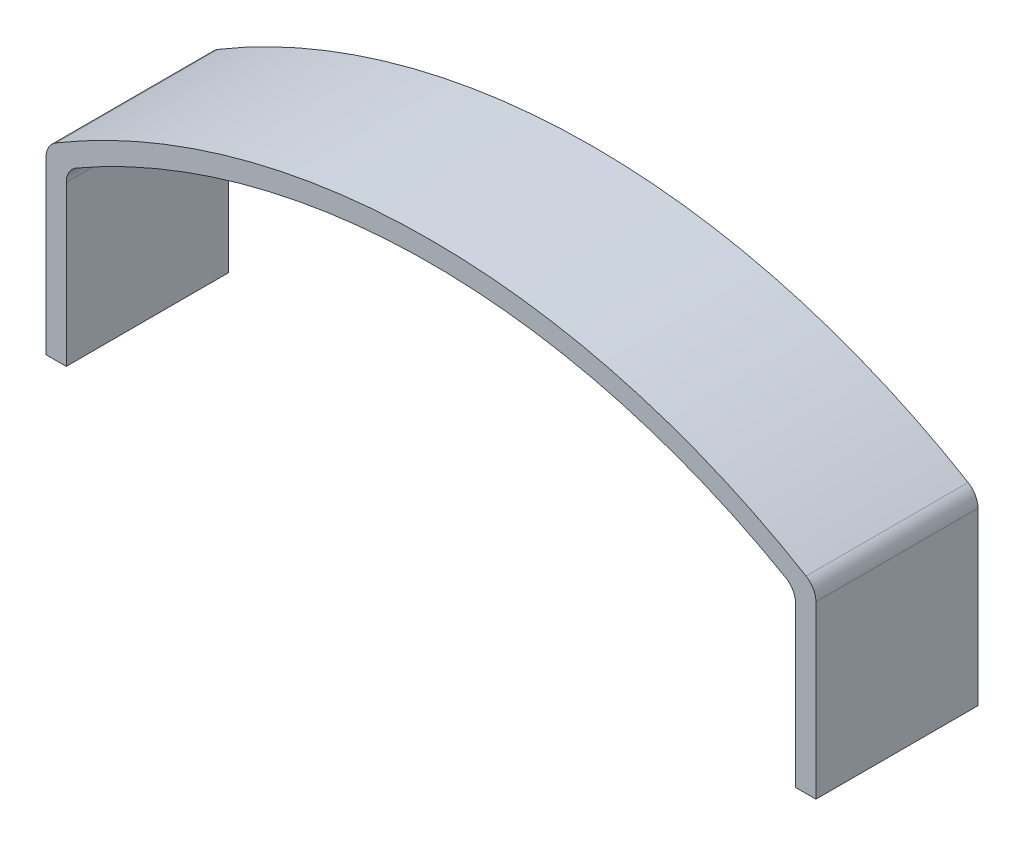
ISO-10303-21;
HEADER;
FILE_DESCRIPTION(('STEP AP214'),'2;1');
FILE_NAME('part.step','',(''),(''),'','','');
FILE_SCHEMA(('AUTOMOTIVE_DESIGN { 1 0 10303 214 1 1 1 1 }'));
ENDSEC;
DATA;
#1=APPLICATION_CONTEXT('core data for automotive mechanical design processes');
#2=APPLICATION_PROTOCOL_DEFINITION('international standard','automotive_design',2000,#1);
#3=PRODUCT_CONTEXT('',#1,'mechanical');
#4=PRODUCT('Part','Part','',(#3));
#5=PRODUCT_RELATED_PRODUCT_CATEGORY('part','',(#4));
#6=PRODUCT_DEFINITION_FORMATION('','',#4);
#7=PRODUCT_DEFINITION_CONTEXT('part definition',#1,'design');
#8=PRODUCT_DEFINITION('design','',#6,#7);
#9=PRODUCT_DEFINITION_SHAPE('','',#8);
#10=(LENGTH_UNIT() NAMED_UNIT(*) SI_UNIT(.MILLI.,.METRE.));
#11=(NAMED_UNIT(*) PLANE_ANGLE_UNIT() SI_UNIT($,.RADIAN.));
#12=(NAMED_UNIT(*) SI_UNIT($,.STERADIAN.) SOLID_ANGLE_UNIT());
#13=UNCERTAINTY_MEASURE_WITH_UNIT(LENGTH_MEASURE(1.E-05),#10,'distance_accuracy_value','');
#14=(GEOMETRIC_REPRESENTATION_CONTEXT(3) GLOBAL_UNCERTAINTY_ASSIGNED_CONTEXT((#13)) GLOBAL_UNIT_ASSIGNED_CONTEXT((#10,
#11,#12)) REPRESENTATION_CONTEXT('',''));
#15=CARTESIAN_POINT('',(0.,0.,0.));
#16=DIRECTION('',(0.,0.,1.));
#17=DIRECTION('',(1.,0.,0.));
#18=AXIS2_PLACEMENT_3D('',#15,#16,#17);
#19=CARTESIAN_POINT('',(-9.5,0.,2.));
#20=DIRECTION('',(0.,1.,0.));
#21=DIRECTION('',(0.,0.,1.));
#22=AXIS2_PLACEMENT_3D('',#19,#20,#21);
#23=PLANE('',#22);
#24=DIRECTION('',(1.,0.,0.));
#25=VECTOR('',#24,1.);
#26=CARTESIAN_POINT('',(-9.5,0.,-2.));
#27=LINE('',#26,#25);
#28=CARTESIAN_POINT('',(-9.5,0.,-2.));
#29=VERTEX_POINT('',#28);
#30=CARTESIAN_POINT('',(-9.,0.,-2.));
#31=VERTEX_POINT('',#30);
#32=EDGE_CURVE('E128',#29,#31,#27,.T.);
#33=ORIENTED_EDGE('',*,*,#32,.T.);
#34=DIRECTION('',(0.,0.,-1.));
#35=VECTOR('',#34,1.);
#36=CARTESIAN_POINT('',(-9.,0.,2.));
#37=LINE('',#36,#35);
#38=CARTESIAN_POINT('',(-9.,0.,2.));
#39=VERTEX_POINT('',#38);
#40=EDGE_CURVE('E110',#39,#31,#37,.T.);
#41=ORIENTED_EDGE('',*,*,#40,.F.);
#42=DIRECTION('',(1.,0.,0.));
#43=VECTOR('',#42,1.);
#44=CARTESIAN_POINT('',(-9.5,0.,2.));
#45=LINE('',#44,#43);
#46=CARTESIAN_POINT('',(-9.5,0.,2.));
#47=VERTEX_POINT('',#46);
#48=EDGE_CURVE('E116',#47,#39,#45,.T.);
#49=ORIENTED_EDGE('',*,*,#48,.F.);
#50=DIRECTION('',(0.,0.,-1.));
#51=VECTOR('',#50,1.);
#52=CARTESIAN_POINT('',(-9.5,0.,2.));
#53=LINE('',#52,#51);
#54=EDGE_CURVE('E189',#47,#29,#53,.T.);
#55=ORIENTED_EDGE('',*,*,#54,.T.);
#56=EDGE_LOOP('',(#33,#41,#49,#55));
#57=FACE_BOUND('',#56,.T.);
#58=ADVANCED_FACE('F16',(#57),#23,.F.);
#59=CARTESIAN_POINT('',(-9.,0.,2.));
#60=DIRECTION('',(-1.,0.,0.));
#61=DIRECTION('',(0.,0.,1.));
#62=AXIS2_PLACEMENT_3D('',#59,#60,#61);
#63=PLANE('',#62);
#64=DIRECTION('',(0.,1.,0.));
#65=VECTOR('',#64,1.);
#66=CARTESIAN_POINT('',(-9.,0.,-2.));
#67=LINE('',#66,#65);
#68=CARTESIAN_POINT('',(-9.,3.93212761140492,-2.));
#69=VERTEX_POINT('',#68);
#70=EDGE_CURVE('E168',#31,#69,#67,.T.);
#71=ORIENTED_EDGE('',*,*,#70,.T.);
#72=DIRECTION('',(0.,0.,1.));
#73=VECTOR('',#72,1.);
#74=CARTESIAN_POINT('',(-9.,3.93212761140492,2.));
#75=LINE('',#74,#73);
#76=CARTESIAN_POINT('',(-9.,3.93212761140492,2.));
#77=VERTEX_POINT('',#76);
#78=EDGE_CURVE('E113',#69,#77,#75,.T.);
#79=ORIENTED_EDGE('',*,*,#78,.T.);
#80=DIRECTION('',(0.,1.,0.));
#81=VECTOR('',#80,1.);
#82=CARTESIAN_POINT('',(-9.,0.,2.));
#83=LINE('',#82,#81);
#84=EDGE_CURVE('E105',#39,#77,#83,.T.);
#85=ORIENTED_EDGE('',*,*,#84,.F.);
#86=ORIENTED_EDGE('',*,*,#40,.T.);
#87=EDGE_LOOP('',(#71,#79,#85,#86));
#88=FACE_BOUND('',#87,.T.);
#89=ADVANCED_FACE('F108',(#88),#63,.F.);
#90=CARTESIAN_POINT('',(0.,-10.8629629128947,2.));
#91=DIRECTION('',(0.,0.,-1.));
#92=DIRECTION('',(-1.,0.,0.));
#93=AXIS2_PLACEMENT_3D('',#90,#91,#92);
#94=CYLINDRICAL_SURFACE('',#93,17.5629629203788);
#95=CARTESIAN_POINT('',(0.,-10.8629629128947,-2.));
#96=DIRECTION('',(0.,0.,-1.));
#97=DIRECTION('',(-1.,0.,0.));
#98=AXIS2_PLACEMENT_3D('',#95,#96,#97);
#99=CIRCLE('',#98,17.5629629203788);
#100=CARTESIAN_POINT('',(-8.74907749139654,4.36567161526106,-2.));
#101=VERTEX_POINT('',#100);
#102=CARTESIAN_POINT('',(8.74907749139653,4.36567161526106,-2.));
#103=VERTEX_POINT('',#102);
#104=EDGE_CURVE('E170',#101,#103,#99,.T.);
#105=ORIENTED_EDGE('',*,*,#104,.T.);
#106=DIRECTION('',(0.,0.,-1.));
#107=VECTOR('',#106,1.);
#108=CARTESIAN_POINT('',(8.74907749139653,4.36567161526107,2.));
#109=LINE('',#108,#107);
#110=CARTESIAN_POINT('',(8.74907749139653,4.36567161526106,2.));
#111=VERTEX_POINT('',#110);
#112=EDGE_CURVE('E156',#103,#111,#109,.F.);
#113=ORIENTED_EDGE('',*,*,#112,.T.);
#114=CARTESIAN_POINT('',(0.,-10.8629629128947,2.));
#115=DIRECTION('',(0.,0.,-1.));
#116=DIRECTION('',(-1.,0.,0.));
#117=AXIS2_PLACEMENT_3D('',#114,#115,#116);
#118=CIRCLE('',#117,17.5629629203788);
#119=CARTESIAN_POINT('',(-8.74907749139654,4.36567161526106,2.));
#120=VERTEX_POINT('',#119);
#121=EDGE_CURVE('E115',#120,#111,#118,.T.);
#122=ORIENTED_EDGE('',*,*,#121,.F.);
#123=DIRECTION('',(0.,0.,-1.));
#124=VECTOR('',#123,1.);
#125=CARTESIAN_POINT('',(-8.74907749139653,4.36567161526106,2.));
#126=LINE('',#125,#124);
#127=EDGE_CURVE('E153',#120,#101,#126,.T.);
#128=ORIENTED_EDGE('',*,*,#127,.T.);
#129=EDGE_LOOP('',(#105,#113,#122,#128));
#130=FACE_BOUND('',#129,.T.);
#131=ADVANCED_FACE('F176',(#130),#94,.F.);
#132=CARTESIAN_POINT('',(9.,4.21873681036591,2.));
#133=DIRECTION('',(1.,0.,0.));
#134=DIRECTION('',(0.,1.,0.));
#135=AXIS2_PLACEMENT_3D('',#132,#133,#134);
#136=PLANE('',#135);
#137=DIRECTION('',(0.,-1.,0.));
#138=VECTOR('',#137,1.);
#139=CARTESIAN_POINT('',(9.,4.21873681036591,2.));
#140=LINE('',#139,#138);
#141=CARTESIAN_POINT('',(9.,3.93212761140493,2.));
#142=VERTEX_POINT('',#141);
#143=CARTESIAN_POINT('',(9.,0.,2.));
#144=VERTEX_POINT('',#143);
#145=EDGE_CURVE('E178',#142,#144,#140,.T.);
#146=ORIENTED_EDGE('',*,*,#145,.F.);
#147=DIRECTION('',(0.,0.,1.));
#148=VECTOR('',#147,1.);
#149=CARTESIAN_POINT('',(9.,3.93212761140493,-2.));
#150=LINE('',#149,#148);
#151=CARTESIAN_POINT('',(9.,3.93212761140493,-2.));
#152=VERTEX_POINT('',#151);
#153=EDGE_CURVE('E150',#142,#152,#150,.F.);
#154=ORIENTED_EDGE('',*,*,#153,.T.);
#155=DIRECTION('',(0.,-1.,0.));
#156=VECTOR('',#155,1.);
#157=CARTESIAN_POINT('',(9.,4.21873681036591,-2.));
#158=LINE('',#157,#156);
#159=CARTESIAN_POINT('',(9.,0.,-2.));
#160=VERTEX_POINT('',#159);
#161=EDGE_CURVE('E192',#152,#160,#158,.T.);
#162=ORIENTED_EDGE('',*,*,#161,.T.);
#163=DIRECTION('',(0.,0.,-1.));
#164=VECTOR('',#163,1.);
#165=CARTESIAN_POINT('',(9.,0.,2.));
#166=LINE('',#165,#164);
#167=EDGE_CURVE('E130',#144,#160,#166,.T.);
#168=ORIENTED_EDGE('',*,*,#167,.F.);
#169=EDGE_LOOP('',(#146,#154,#162,#168));
#170=FACE_BOUND('',#169,.T.);
#171=ADVANCED_FACE('F322',(#170),#136,.F.);
#172=CARTESIAN_POINT('',(9.,0.,2.));
#173=DIRECTION('',(0.,1.,0.));
#174=DIRECTION('',(-1.,0.,0.));
#175=AXIS2_PLACEMENT_3D('',#172,#173,#174);
#176=PLANE('',#175);
#177=DIRECTION('',(1.,0.,0.));
#178=VECTOR('',#177,1.);
#179=CARTESIAN_POINT('',(9.,0.,-2.));
#180=LINE('',#179,#178);
#181=CARTESIAN_POINT('',(9.5,0.,-2.));
#182=VERTEX_POINT('',#181);
#183=EDGE_CURVE('E194',#160,#182,#180,.T.);
#184=ORIENTED_EDGE('',*,*,#183,.T.);
#185=DIRECTION('',(0.,0.,-1.));
#186=VECTOR('',#185,1.);
#187=CARTESIAN_POINT('',(9.5,0.,2.));
#188=LINE('',#187,#186);
#189=CARTESIAN_POINT('',(9.5,0.,2.));
#190=VERTEX_POINT('',#189);
#191=EDGE_CURVE('E135',#190,#182,#188,.T.);
#192=ORIENTED_EDGE('',*,*,#191,.F.);
#193=DIRECTION('',(1.,0.,0.));
#194=VECTOR('',#193,1.);
#195=CARTESIAN_POINT('',(9.,0.,2.));
#196=LINE('',#195,#194);
#197=EDGE_CURVE('E180',#144,#190,#196,.T.);
#198=ORIENTED_EDGE('',*,*,#197,.F.);
#199=ORIENTED_EDGE('',*,*,#167,.T.);
#200=EDGE_LOOP('',(#184,#192,#198,#199));
#201=FACE_BOUND('',#200,.T.);
#202=ADVANCED_FACE('F313',(#201),#176,.F.);
#203=CARTESIAN_POINT('',(9.5,4.5,2.));
#204=DIRECTION('',(-1.,0.,0.));
#205=DIRECTION('',(0.,-1.,0.));
#206=AXIS2_PLACEMENT_3D('',#203,#204,#205);
#207=PLANE('',#206);
#208=DIRECTION('',(0.,1.,0.));
#209=VECTOR('',#208,1.);
#210=CARTESIAN_POINT('',(9.5,4.5,-2.));
#211=LINE('',#210,#209);
#212=CARTESIAN_POINT('',(9.5,4.21873681036591,-2.));
#213=VERTEX_POINT('',#212);
#214=EDGE_CURVE('E196',#182,#213,#211,.T.);
#215=ORIENTED_EDGE('',*,*,#214,.T.);
#216=DIRECTION('',(0.,0.,-1.));
#217=VECTOR('',#216,1.);
#218=CARTESIAN_POINT('',(9.5,4.21873681036591,2.));
#219=LINE('',#218,#217);
#220=CARTESIAN_POINT('',(9.5,4.21873681036591,2.));
#221=VERTEX_POINT('',#220);
#222=EDGE_CURVE('E145',#213,#221,#219,.F.);
#223=ORIENTED_EDGE('',*,*,#222,.T.);
#224=DIRECTION('',(0.,1.,0.));
#225=VECTOR('',#224,1.);
#226=CARTESIAN_POINT('',(9.5,4.5,2.));
#227=LINE('',#226,#225);
#228=EDGE_CURVE('E184',#190,#221,#227,.T.);
#229=ORIENTED_EDGE('',*,*,#228,.F.);
#230=ORIENTED_EDGE('',*,*,#191,.T.);
#231=EDGE_LOOP('',(#215,#223,#229,#230));
#232=FACE_BOUND('',#231,.T.);
#233=ADVANCED_FACE('F208',(#232),#207,.F.);
#234=CARTESIAN_POINT('',(0.,-10.8629629128947,2.));
#235=DIRECTION('',(0.,0.,-1.));
#236=DIRECTION('',(-1.,0.,0.));
#237=AXIS2_PLACEMENT_3D('',#234,#235,#236);
#238=CYLINDRICAL_SURFACE('',#237,18.0629629203788);
#239=CARTESIAN_POINT('',(0.,-10.8629629128947,2.));
#240=DIRECTION('',(0.,0.,1.));
#241=DIRECTION('',(-1.,0.,0.));
#242=AXIS2_PLACEMENT_3D('',#239,#240,#241);
#243=CIRCLE('',#242,18.0629629203788);
#244=CARTESIAN_POINT('',(9.25622100441711,4.64809772718938,2.));
#245=VERTEX_POINT('',#244);
#246=CARTESIAN_POINT('',(-9.25622100441712,4.64809772718938,2.));
#247=VERTEX_POINT('',#246);
#248=EDGE_CURVE('E186',#245,#247,#243,.T.);
#249=ORIENTED_EDGE('',*,*,#248,.F.);
#250=DIRECTION('',(0.,0.,-1.));
#251=VECTOR('',#250,1.);
#252=CARTESIAN_POINT('',(9.25622100441711,4.64809772718938,2.));
#253=LINE('',#252,#251);
#254=CARTESIAN_POINT('',(9.25622100441711,4.64809772718938,-2.));
#255=VERTEX_POINT('',#254);
#256=EDGE_CURVE('E132',#245,#255,#253,.T.);
#257=ORIENTED_EDGE('',*,*,#256,.T.);
#258=CARTESIAN_POINT('',(0.,-10.8629629128947,-2.));
#259=DIRECTION('',(0.,0.,1.));
#260=DIRECTION('',(-1.,0.,0.));
#261=AXIS2_PLACEMENT_3D('',#258,#259,#260);
#262=CIRCLE('',#261,18.0629629203788);
#263=CARTESIAN_POINT('',(-9.25622100441712,4.64809772718938,-2.));
#264=VERTEX_POINT('',#263);
#265=EDGE_CURVE('E199',#255,#264,#262,.T.);
#266=ORIENTED_EDGE('',*,*,#265,.T.);
#267=DIRECTION('',(0.,0.,-1.));
#268=VECTOR('',#267,1.);
#269=CARTESIAN_POINT('',(-9.25622100441712,4.64809772718938,2.));
#270=LINE('',#269,#268);
#271=EDGE_CURVE('E129',#264,#247,#270,.F.);
#272=ORIENTED_EDGE('',*,*,#271,.T.);
#273=EDGE_LOOP('',(#249,#257,#266,#272));
#274=FACE_BOUND('',#273,.T.);
#275=ADVANCED_FACE('F220',(#274),#238,.T.);
#276=CARTESIAN_POINT('',(-9.5,0.,2.));
#277=DIRECTION('',(1.,0.,0.));
#278=DIRECTION('',(0.,0.,-1.));
#279=AXIS2_PLACEMENT_3D('',#276,#277,#278);
#280=PLANE('',#279);
#281=DIRECTION('',(0.,-1.,0.));
#282=VECTOR('',#281,1.);
#283=CARTESIAN_POINT('',(-9.5,0.,2.));
#284=LINE('',#283,#282);
#285=CARTESIAN_POINT('',(-9.5,4.21873681036591,2.));
#286=VERTEX_POINT('',#285);
#287=EDGE_CURVE('E121',#286,#47,#284,.T.);
#288=ORIENTED_EDGE('',*,*,#287,.F.);
#289=DIRECTION('',(0.,0.,-1.));
#290=VECTOR('',#289,1.);
#291=CARTESIAN_POINT('',(-9.5,4.21873681036591,2.));
#292=LINE('',#291,#290);
#293=CARTESIAN_POINT('',(-9.5,4.21873681036591,-2.));
#294=VERTEX_POINT('',#293);
#295=EDGE_CURVE('E158',#286,#294,#292,.T.);
#296=ORIENTED_EDGE('',*,*,#295,.T.);
#297=DIRECTION('',(0.,-1.,0.));
#298=VECTOR('',#297,1.);
#299=CARTESIAN_POINT('',(-9.5,0.,-2.));
#300=LINE('',#299,#298);
#301=EDGE_CURVE('E125',#294,#29,#300,.T.);
#302=ORIENTED_EDGE('',*,*,#301,.T.);
#303=ORIENTED_EDGE('',*,*,#54,.F.);
#304=EDGE_LOOP('',(#288,#296,#302,#303));
#305=FACE_BOUND('',#304,.T.);
#306=ADVANCED_FACE('F227',(#305),#280,.F.);
#307=CARTESIAN_POINT('',(0.,-10.8629629128947,2.));
#308=DIRECTION('',(0.,0.,-1.));
#309=DIRECTION('',(-1.,0.,0.));
#310=AXIS2_PLACEMENT_3D('',#307,#308,#309);
#311=PLANE('',#310);
#312=ORIENTED_EDGE('',*,*,#228,.T.);
#313=CARTESIAN_POINT('',(9.,4.21873681036591,2.));
#314=DIRECTION('',(0.,0.,-1.));
#315=DIRECTION('',(-1.,0.,0.));
#316=AXIS2_PLACEMENT_3D('',#313,#314,#315);
#317=CIRCLE('',#316,0.5);
#318=EDGE_CURVE('E148',#221,#245,#317,.F.);
#319=ORIENTED_EDGE('',*,*,#318,.T.);
#320=ORIENTED_EDGE('',*,*,#248,.T.);
#321=CARTESIAN_POINT('',(-9.,4.21873681036591,2.));
#322=DIRECTION('',(0.,0.,-1.));
#323=DIRECTION('',(-1.,0.,0.));
#324=AXIS2_PLACEMENT_3D('',#321,#322,#323);
#325=CIRCLE('',#324,0.5);
#326=EDGE_CURVE('E31',#247,#286,#325,.F.);
#327=ORIENTED_EDGE('',*,*,#326,.T.);
#328=ORIENTED_EDGE('',*,*,#287,.T.);
#329=ORIENTED_EDGE('',*,*,#48,.T.);
#330=ORIENTED_EDGE('',*,*,#84,.T.);
#331=CARTESIAN_POINT('',(-8.5,3.93212761140492,2.));
#332=DIRECTION('',(0.,0.,-1.));
#333=DIRECTION('',(-1.,0.,0.));
#334=AXIS2_PLACEMENT_3D('',#331,#332,#333);
#335=CIRCLE('',#334,0.5);
#336=EDGE_CURVE('E10',#77,#120,#335,.T.);
#337=ORIENTED_EDGE('',*,*,#336,.T.);
#338=ORIENTED_EDGE('',*,*,#121,.T.);
#339=CARTESIAN_POINT('',(8.5,3.93212761140493,2.));
#340=DIRECTION('',(0.,0.,-1.));
#341=DIRECTION('',(-1.,0.,0.));
#342=AXIS2_PLACEMENT_3D('',#339,#340,#341);
#343=CIRCLE('',#342,0.5);
#344=EDGE_CURVE('E38',#111,#142,#343,.T.);
#345=ORIENTED_EDGE('',*,*,#344,.T.);
#346=ORIENTED_EDGE('',*,*,#145,.T.);
#347=ORIENTED_EDGE('',*,*,#197,.T.);
#348=EDGE_LOOP('',(#312,#319,#320,#327,#328,#329,#330,#337,#338,#345,#346,#347));
#349=FACE_BOUND('',#348,.T.);
#350=ADVANCED_FACE('F120',(#349),#311,.F.);
#351=CARTESIAN_POINT('',(0.,-10.8629629128947,-2.));
#352=DIRECTION('',(0.,0.,-1.));
#353=DIRECTION('',(-1.,0.,0.));
#354=AXIS2_PLACEMENT_3D('',#351,#352,#353);
#355=PLANE('',#354);
#356=ORIENTED_EDGE('',*,*,#265,.F.);
#357=CARTESIAN_POINT('',(9.,4.21873681036591,-2.));
#358=DIRECTION('',(0.,0.,-1.));
#359=DIRECTION('',(-1.,0.,0.));
#360=AXIS2_PLACEMENT_3D('',#357,#358,#359);
#361=CIRCLE('',#360,0.5);
#362=EDGE_CURVE('E143',#255,#213,#361,.T.);
#363=ORIENTED_EDGE('',*,*,#362,.T.);
#364=ORIENTED_EDGE('',*,*,#214,.F.);
#365=ORIENTED_EDGE('',*,*,#183,.F.);
#366=ORIENTED_EDGE('',*,*,#161,.F.);
#367=CARTESIAN_POINT('',(8.5,3.93212761140493,-2.));
#368=DIRECTION('',(0.,0.,-1.));
#369=DIRECTION('',(-1.,0.,0.));
#370=AXIS2_PLACEMENT_3D('',#367,#368,#369);
#371=CIRCLE('',#370,0.5);
#372=EDGE_CURVE('E162',#152,#103,#371,.F.);
#373=ORIENTED_EDGE('',*,*,#372,.T.);
#374=ORIENTED_EDGE('',*,*,#104,.F.);
#375=CARTESIAN_POINT('',(-8.5,3.93212761140492,-2.));
#376=DIRECTION('',(0.,0.,-1.));
#377=DIRECTION('',(-1.,0.,0.));
#378=AXIS2_PLACEMENT_3D('',#375,#376,#377);
#379=CIRCLE('',#378,0.5);
#380=EDGE_CURVE('E24',#101,#69,#379,.F.);
#381=ORIENTED_EDGE('',*,*,#380,.T.);
#382=ORIENTED_EDGE('',*,*,#70,.F.);
#383=ORIENTED_EDGE('',*,*,#32,.F.);
#384=ORIENTED_EDGE('',*,*,#301,.F.);
#385=CARTESIAN_POINT('',(-9.,4.21873681036591,-2.));
#386=DIRECTION('',(0.,0.,-1.));
#387=DIRECTION('',(-1.,0.,0.));
#388=AXIS2_PLACEMENT_3D('',#385,#386,#387);
#389=CIRCLE('',#388,0.5);
#390=EDGE_CURVE('E141',#294,#264,#389,.T.);
#391=ORIENTED_EDGE('',*,*,#390,.T.);
#392=EDGE_LOOP('',(#356,#363,#364,#365,#366,#373,#374,#381,#382,#383,#384,#391));
#393=FACE_BOUND('',#392,.T.);
#394=ADVANCED_FACE('F167',(#393),#355,.T.);
#395=CARTESIAN_POINT('',(9.,4.21873681036591,2.));
#396=DIRECTION('',(0.,0.,-1.));
#397=DIRECTION('',(-1.,0.,0.));
#398=AXIS2_PLACEMENT_3D('',#395,#396,#397);
#399=CYLINDRICAL_SURFACE('',#398,0.5);
#400=ORIENTED_EDGE('',*,*,#318,.F.);
#401=ORIENTED_EDGE('',*,*,#222,.F.);
#402=ORIENTED_EDGE('',*,*,#362,.F.);
#403=ORIENTED_EDGE('',*,*,#256,.F.);
#404=EDGE_LOOP('',(#400,#401,#402,#403));
#405=FACE_BOUND('',#404,.T.);
#406=ADVANCED_FACE('F217',(#405),#399,.T.);
#407=CARTESIAN_POINT('',(8.5,3.93212761140493,2.));
#408=DIRECTION('',(0.,0.,-1.));
#409=DIRECTION('',(-1.,0.,0.));
#410=AXIS2_PLACEMENT_3D('',#407,#408,#409);
#411=CYLINDRICAL_SURFACE('',#410,0.5);
#412=ORIENTED_EDGE('',*,*,#344,.F.);
#413=ORIENTED_EDGE('',*,*,#112,.F.);
#414=ORIENTED_EDGE('',*,*,#372,.F.);
#415=ORIENTED_EDGE('',*,*,#153,.F.);
#416=EDGE_LOOP('',(#412,#413,#414,#415));
#417=FACE_BOUND('',#416,.T.);
#418=ADVANCED_FACE('F248',(#417),#411,.F.);
#419=CARTESIAN_POINT('',(-9.,4.21873681036591,2.));
#420=DIRECTION('',(0.,0.,-1.));
#421=DIRECTION('',(-1.,0.,0.));
#422=AXIS2_PLACEMENT_3D('',#419,#420,#421);
#423=CYLINDRICAL_SURFACE('',#422,0.5);
#424=ORIENTED_EDGE('',*,*,#326,.F.);
#425=ORIENTED_EDGE('',*,*,#271,.F.);
#426=ORIENTED_EDGE('',*,*,#390,.F.);
#427=ORIENTED_EDGE('',*,*,#295,.F.);
#428=EDGE_LOOP('',(#424,#425,#426,#427));
#429=FACE_BOUND('',#428,.T.);
#430=ADVANCED_FACE('F224',(#429),#423,.T.);
#431=CARTESIAN_POINT('',(-8.5,3.93212761140492,2.));
#432=DIRECTION('',(0.,0.,-1.));
#433=DIRECTION('',(-1.,0.,0.));
#434=AXIS2_PLACEMENT_3D('',#431,#432,#433);
#435=CYLINDRICAL_SURFACE('',#434,0.5);
#436=ORIENTED_EDGE('',*,*,#336,.F.);
#437=ORIENTED_EDGE('',*,*,#78,.F.);
#438=ORIENTED_EDGE('',*,*,#380,.F.);
#439=ORIENTED_EDGE('',*,*,#127,.F.);
#440=EDGE_LOOP('',(#436,#437,#438,#439));
#441=FACE_BOUND('',#440,.T.);
#442=ADVANCED_FACE('F18',(#441),#435,.F.);
#443=CLOSED_SHELL('',(#58,#89,#131,#171,#202,#233,#275,#306,#350,#394,#406,#418,#430,#442));
#444=MANIFOLD_SOLID_BREP('B1',#443);
#445=ADVANCED_BREP_SHAPE_REPRESENTATION('',(#18,#444),#14);
#446=SHAPE_DEFINITION_REPRESENTATION(#9,#445);
ENDSEC;
END-ISO-10303-21;
